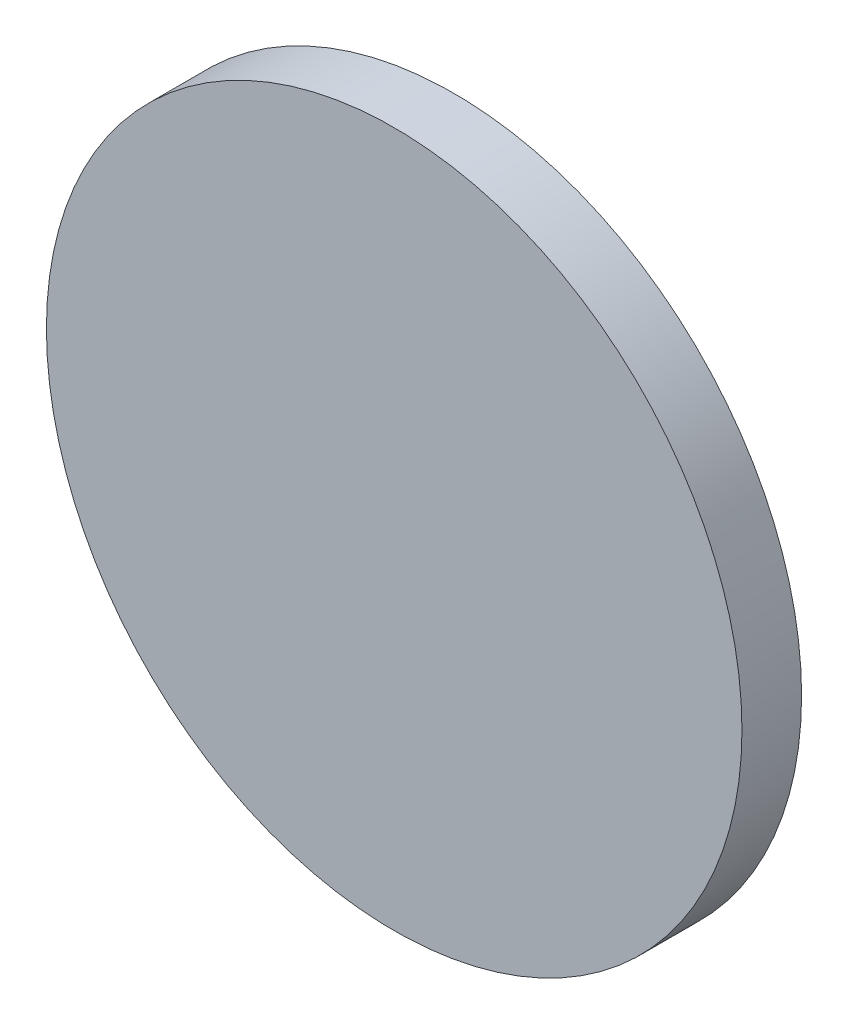
ISO-10303-21;
HEADER;
FILE_DESCRIPTION(('STEP AP214'),'2;1');
FILE_NAME('part.step','',(''),(''),'','','');
FILE_SCHEMA(('AUTOMOTIVE_DESIGN { 1 0 10303 214 1 1 1 1 }'));
ENDSEC;
DATA;
#1=APPLICATION_CONTEXT('core data for automotive mechanical design processes');
#2=APPLICATION_PROTOCOL_DEFINITION('international standard','automotive_design',2000,#1);
#3=PRODUCT_CONTEXT('',#1,'mechanical');
#4=PRODUCT('Part','Part','',(#3));
#5=PRODUCT_RELATED_PRODUCT_CATEGORY('part','',(#4));
#6=PRODUCT_DEFINITION_FORMATION('','',#4);
#7=PRODUCT_DEFINITION_CONTEXT('part definition',#1,'design');
#8=PRODUCT_DEFINITION('design','',#6,#7);
#9=PRODUCT_DEFINITION_SHAPE('','',#8);
#10=(LENGTH_UNIT() NAMED_UNIT(*) SI_UNIT(.MILLI.,.METRE.));
#11=(NAMED_UNIT(*) PLANE_ANGLE_UNIT() SI_UNIT($,.RADIAN.));
#12=(NAMED_UNIT(*) SI_UNIT($,.STERADIAN.) SOLID_ANGLE_UNIT());
#13=UNCERTAINTY_MEASURE_WITH_UNIT(LENGTH_MEASURE(1.E-05),#10,'distance_accuracy_value','');
#14=(GEOMETRIC_REPRESENTATION_CONTEXT(3) GLOBAL_UNCERTAINTY_ASSIGNED_CONTEXT((#13)) GLOBAL_UNIT_ASSIGNED_CONTEXT((#10,
#11,#12)) REPRESENTATION_CONTEXT('',''));
#15=CARTESIAN_POINT('',(0.,0.,0.));
#16=DIRECTION('',(0.,0.,1.));
#17=DIRECTION('',(1.,0.,0.));
#18=AXIS2_PLACEMENT_3D('',#15,#16,#17);
#19=CARTESIAN_POINT('',(7.328,8.839,0.76487));
#20=DIRECTION('',(0.,0.,-1.));
#21=DIRECTION('',(-1.,0.,0.));
#22=AXIS2_PLACEMENT_3D('',#19,#20,#21);
#23=PLANE('',#22);
#24=CARTESIAN_POINT('',(7.328,8.839,0.76487));
#25=DIRECTION('',(0.,0.,1.));
#26=DIRECTION('',(1.,0.,0.));
#27=AXIS2_PLACEMENT_3D('',#24,#25,#26);
#28=CIRCLE('',#27,0.200024667);
#29=CARTESIAN_POINT('',(7.528024667,8.839,0.76487));
#30=VERTEX_POINT('',#29);
#31=EDGE_CURVE('E18',#30,#30,#28,.T.);
#32=ORIENTED_EDGE('',*,*,#31,.F.);
#33=EDGE_LOOP('',(#32));
#34=FACE_BOUND('',#33,.T.);
#35=ADVANCED_FACE('F15',(#34),#23,.T.);
#36=CARTESIAN_POINT('',(7.328,8.839,0.76487));
#37=DIRECTION('',(0.,0.,1.));
#38=DIRECTION('',(1.,0.,0.));
#39=AXIS2_PLACEMENT_3D('',#36,#37,#38);
#40=CYLINDRICAL_SURFACE('',#39,0.200024667);
#41=CARTESIAN_POINT('',(7.328,8.839,0.79916));
#42=DIRECTION('',(0.,0.,1.));
#43=DIRECTION('',(1.,0.,0.));
#44=AXIS2_PLACEMENT_3D('',#41,#42,#43);
#45=CIRCLE('',#44,0.200024667);
#46=CARTESIAN_POINT('',(7.528024667,8.839,0.79916));
#47=VERTEX_POINT('',#46);
#48=EDGE_CURVE('E10',#47,#47,#45,.T.);
#49=ORIENTED_EDGE('',*,*,#48,.F.);
#50=EDGE_LOOP('',(#49));
#51=FACE_BOUND('',#50,.T.);
#52=ORIENTED_EDGE('',*,*,#31,.T.);
#53=EDGE_LOOP('',(#52));
#54=FACE_BOUND('',#53,.T.);
#55=ADVANCED_FACE('F27',(#51,#54),#40,.T.);
#56=CARTESIAN_POINT('',(7.328,8.839,0.79916));
#57=DIRECTION('',(0.,0.,1.));
#58=DIRECTION('',(1.,0.,0.));
#59=AXIS2_PLACEMENT_3D('',#56,#57,#58);
#60=PLANE('',#59);
#61=ORIENTED_EDGE('',*,*,#48,.T.);
#62=EDGE_LOOP('',(#61));
#63=FACE_BOUND('',#62,.T.);
#64=ADVANCED_FACE('F34',(#63),#60,.T.);
#65=CLOSED_SHELL('',(#35,#55,#64));
#66=MANIFOLD_SOLID_BREP('B1',#65);
#67=ADVANCED_BREP_SHAPE_REPRESENTATION('',(#18,#66),#14);
#68=SHAPE_DEFINITION_REPRESENTATION(#9,#67);
ENDSEC;
END-ISO-10303-21;
